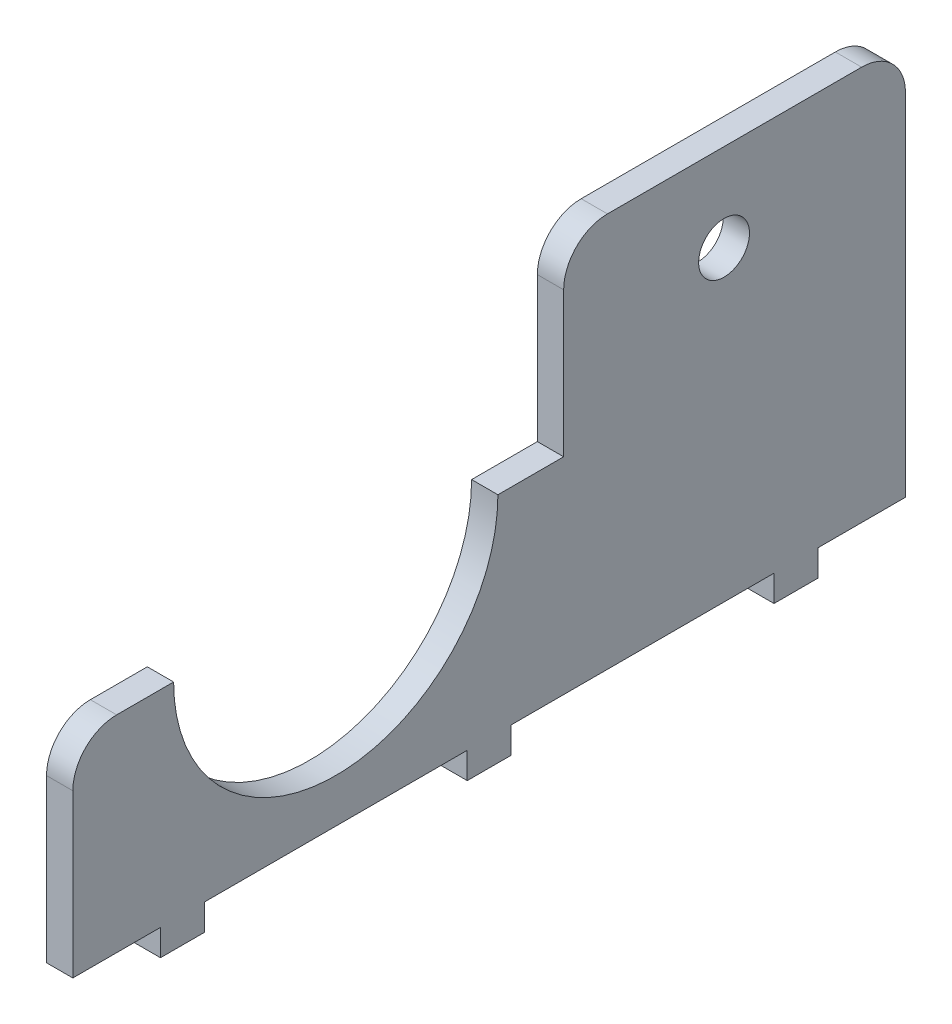
ISO-10303-21;
HEADER;
FILE_DESCRIPTION(('STEP AP214'),'2;1');
FILE_NAME('part.step','',(''),(''),'','','');
FILE_SCHEMA(('AUTOMOTIVE_DESIGN { 1 0 10303 214 1 1 1 1 }'));
ENDSEC;
DATA;
#1=APPLICATION_CONTEXT('core data for automotive mechanical design processes');
#2=APPLICATION_PROTOCOL_DEFINITION('international standard','automotive_design',2000,#1);
#3=PRODUCT_CONTEXT('',#1,'mechanical');
#4=PRODUCT('Part','Part','',(#3));
#5=PRODUCT_RELATED_PRODUCT_CATEGORY('part','',(#4));
#6=PRODUCT_DEFINITION_FORMATION('','',#4);
#7=PRODUCT_DEFINITION_CONTEXT('part definition',#1,'design');
#8=PRODUCT_DEFINITION('design','',#6,#7);
#9=PRODUCT_DEFINITION_SHAPE('','',#8);
#10=(LENGTH_UNIT() NAMED_UNIT(*) SI_UNIT(.MILLI.,.METRE.));
#11=(NAMED_UNIT(*) PLANE_ANGLE_UNIT() SI_UNIT($,.RADIAN.));
#12=(NAMED_UNIT(*) SI_UNIT($,.STERADIAN.) SOLID_ANGLE_UNIT());
#13=UNCERTAINTY_MEASURE_WITH_UNIT(LENGTH_MEASURE(1.E-05),#10,'distance_accuracy_value','');
#14=(GEOMETRIC_REPRESENTATION_CONTEXT(3) GLOBAL_UNCERTAINTY_ASSIGNED_CONTEXT((#13)) GLOBAL_UNIT_ASSIGNED_CONTEXT((#10,
#11,#12)) REPRESENTATION_CONTEXT('',''));
#15=CARTESIAN_POINT('',(0.,0.,0.));
#16=DIRECTION('',(0.,0.,1.));
#17=DIRECTION('',(1.,0.,0.));
#18=AXIS2_PLACEMENT_3D('',#15,#16,#17);
#19=CARTESIAN_POINT('',(3.,11.75,-47.5));
#20=DIRECTION('',(0.,-1.,0.));
#21=DIRECTION('',(0.,0.,-1.));
#22=AXIS2_PLACEMENT_3D('',#19,#20,#21);
#23=PLANE('',#22);
#24=DIRECTION('',(1.,0.,0.));
#25=VECTOR('',#24,1.);
#26=CARTESIAN_POINT('',(3.,11.75,-8.50000000000001));
#27=LINE('',#26,#25);
#28=CARTESIAN_POINT('',(0.,11.75,-8.50000000000001));
#29=VERTEX_POINT('',#28);
#30=CARTESIAN_POINT('',(3.,11.75,-8.50000000000003));
#31=VERTEX_POINT('',#30);
#32=EDGE_CURVE('E197',#29,#31,#27,.T.);
#33=ORIENTED_EDGE('',*,*,#32,.F.);
#34=DIRECTION('',(0.,0.,1.));
#35=VECTOR('',#34,1.);
#36=CARTESIAN_POINT('',(0.,11.75,-47.5));
#37=LINE('',#36,#35);
#38=CARTESIAN_POINT('',(0.,11.75,-1.00000000000001));
#39=VERTEX_POINT('',#38);
#40=EDGE_CURVE('E205',#29,#39,#37,.T.);
#41=ORIENTED_EDGE('',*,*,#40,.T.);
#42=DIRECTION('',(-1.,0.,0.));
#43=VECTOR('',#42,1.);
#44=CARTESIAN_POINT('',(3.,11.75,-1.00000000000001));
#45=LINE('',#44,#43);
#46=CARTESIAN_POINT('',(3.,11.75,-1.00000000000001));
#47=VERTEX_POINT('',#46);
#48=EDGE_CURVE('E338',#47,#39,#45,.T.);
#49=ORIENTED_EDGE('',*,*,#48,.F.);
#50=DIRECTION('',(0.,0.,1.));
#51=VECTOR('',#50,1.);
#52=CARTESIAN_POINT('',(3.,11.75,-47.5));
#53=LINE('',#52,#51);
#54=EDGE_CURVE('E216',#31,#47,#53,.T.);
#55=ORIENTED_EDGE('',*,*,#54,.F.);
#56=EDGE_LOOP('',(#33,#41,#49,#55));
#57=FACE_BOUND('',#56,.T.);
#58=ADVANCED_FACE('F39',(#57),#23,.F.);
#59=CARTESIAN_POINT('',(3.,-11.75,-47.5));
#60=DIRECTION('',(0.,1.,0.));
#61=DIRECTION('',(0.,0.,1.));
#62=AXIS2_PLACEMENT_3D('',#59,#60,#61);
#63=PLANE('',#62);
#64=DIRECTION('',(1.,0.,0.));
#65=VECTOR('',#64,1.);
#66=CARTESIAN_POINT('',(0.,-11.75,32.5));
#67=LINE('',#66,#65);
#68=CARTESIAN_POINT('',(0.,-11.75,32.5));
#69=VERTEX_POINT('',#68);
#70=CARTESIAN_POINT('',(3.,-11.75,32.5));
#71=VERTEX_POINT('',#70);
#72=EDGE_CURVE('E201',#69,#71,#67,.T.);
#73=ORIENTED_EDGE('',*,*,#72,.F.);
#74=DIRECTION('',(0.,0.,-1.));
#75=VECTOR('',#74,1.);
#76=CARTESIAN_POINT('',(0.,-11.75,-47.5));
#77=LINE('',#76,#75);
#78=CARTESIAN_POINT('',(0.,-11.75,2.49999999999998));
#79=VERTEX_POINT('',#78);
#80=EDGE_CURVE('E330',#69,#79,#77,.T.);
#81=ORIENTED_EDGE('',*,*,#80,.T.);
#82=DIRECTION('',(-1.,0.,0.));
#83=VECTOR('',#82,1.);
#84=CARTESIAN_POINT('',(0.,-11.75,2.49999999999998));
#85=LINE('',#84,#83);
#86=CARTESIAN_POINT('',(3.,-11.75,2.49999999999998));
#87=VERTEX_POINT('',#86);
#88=EDGE_CURVE('E259',#87,#79,#85,.T.);
#89=ORIENTED_EDGE('',*,*,#88,.F.);
#90=DIRECTION('',(0.,0.,-1.));
#91=VECTOR('',#90,1.);
#92=CARTESIAN_POINT('',(3.,-11.75,-47.5));
#93=LINE('',#92,#91);
#94=EDGE_CURVE('E317',#71,#87,#93,.T.);
#95=ORIENTED_EDGE('',*,*,#94,.F.);
#96=EDGE_LOOP('',(#73,#81,#89,#95));
#97=FACE_BOUND('',#96,.T.);
#98=ADVANCED_FACE('F392',(#97),#63,.F.);
#99=DIRECTION('',(-1.,0.,0.));
#100=VECTOR('',#99,1.);
#101=CARTESIAN_POINT('',(0.,-11.75,37.5));
#102=LINE('',#101,#100);
#103=CARTESIAN_POINT('',(3.,-11.75,37.5));
#104=VERTEX_POINT('',#103);
#105=CARTESIAN_POINT('',(0.,-11.75,37.5));
#106=VERTEX_POINT('',#105);
#107=EDGE_CURVE('E232',#104,#106,#102,.T.);
#108=ORIENTED_EDGE('',*,*,#107,.F.);
#109=CARTESIAN_POINT('',(3.,-11.75,47.5));
#110=VERTEX_POINT('',#109);
#111=EDGE_CURVE('E313',#110,#104,#93,.T.);
#112=ORIENTED_EDGE('',*,*,#111,.F.);
#113=DIRECTION('',(-1.,0.,0.));
#114=VECTOR('',#113,1.);
#115=CARTESIAN_POINT('',(3.,-11.75,47.5));
#116=LINE('',#115,#114);
#117=CARTESIAN_POINT('',(0.,-11.75,47.5));
#118=VERTEX_POINT('',#117);
#119=EDGE_CURVE('E343',#110,#118,#116,.T.);
#120=ORIENTED_EDGE('',*,*,#119,.T.);
#121=EDGE_CURVE('E328',#118,#106,#77,.T.);
#122=ORIENTED_EDGE('',*,*,#121,.T.);
#123=EDGE_LOOP('',(#108,#112,#120,#122));
#124=FACE_BOUND('',#123,.T.);
#125=ADVANCED_FACE('F397',(#124),#63,.F.);
#126=DIRECTION('',(1.,0.,0.));
#127=VECTOR('',#126,1.);
#128=CARTESIAN_POINT('',(0.,-11.75,-2.50000000000002));
#129=LINE('',#128,#127);
#130=CARTESIAN_POINT('',(0.,-11.75,-2.50000000000002));
#131=VERTEX_POINT('',#130);
#132=CARTESIAN_POINT('',(3.,-11.75,-2.50000000000002));
#133=VERTEX_POINT('',#132);
#134=EDGE_CURVE('E254',#131,#133,#129,.T.);
#135=ORIENTED_EDGE('',*,*,#134,.F.);
#136=CARTESIAN_POINT('',(0.,-11.75,-32.5));
#137=VERTEX_POINT('',#136);
#138=EDGE_CURVE('E431',#131,#137,#77,.T.);
#139=ORIENTED_EDGE('',*,*,#138,.T.);
#140=DIRECTION('',(-1.,0.,0.));
#141=VECTOR('',#140,1.);
#142=CARTESIAN_POINT('',(0.,-11.75,-32.5));
#143=LINE('',#142,#141);
#144=CARTESIAN_POINT('',(3.,-11.75,-32.5));
#145=VERTEX_POINT('',#144);
#146=EDGE_CURVE('E286',#145,#137,#143,.T.);
#147=ORIENTED_EDGE('',*,*,#146,.F.);
#148=EDGE_CURVE('E450',#133,#145,#93,.T.);
#149=ORIENTED_EDGE('',*,*,#148,.F.);
#150=EDGE_LOOP('',(#135,#139,#147,#149));
#151=FACE_BOUND('',#150,.T.);
#152=ADVANCED_FACE('F400',(#151),#63,.F.);
#153=DIRECTION('',(1.,0.,0.));
#154=VECTOR('',#153,1.);
#155=CARTESIAN_POINT('',(0.,-11.75,-37.5));
#156=LINE('',#155,#154);
#157=CARTESIAN_POINT('',(0.,-11.75,-37.5));
#158=VERTEX_POINT('',#157);
#159=CARTESIAN_POINT('',(3.00000000000002,-11.75,-37.5));
#160=VERTEX_POINT('',#159);
#161=EDGE_CURVE('E281',#158,#160,#156,.T.);
#162=ORIENTED_EDGE('',*,*,#161,.F.);
#163=CARTESIAN_POINT('',(0.,-11.75,-47.5));
#164=VERTEX_POINT('',#163);
#165=EDGE_CURVE('E327',#158,#164,#77,.T.);
#166=ORIENTED_EDGE('',*,*,#165,.T.);
#167=DIRECTION('',(-1.,0.,0.));
#168=VECTOR('',#167,1.);
#169=CARTESIAN_POINT('',(3.,-11.75,-47.5));
#170=LINE('',#169,#168);
#171=CARTESIAN_POINT('',(3.,-11.75,-47.5));
#172=VERTEX_POINT('',#171);
#173=EDGE_CURVE('E340',#172,#164,#170,.T.);
#174=ORIENTED_EDGE('',*,*,#173,.F.);
#175=EDGE_CURVE('E311',#160,#172,#93,.T.);
#176=ORIENTED_EDGE('',*,*,#175,.F.);
#177=EDGE_LOOP('',(#162,#166,#174,#176));
#178=FACE_BOUND('',#177,.T.);
#179=ADVANCED_FACE('F409',(#178),#63,.F.);
#180=CARTESIAN_POINT('',(3.,-11.75,47.5));
#181=DIRECTION('',(0.,0.,-1.));
#182=DIRECTION('',(-1.,0.,0.));
#183=AXIS2_PLACEMENT_3D('',#180,#181,#182);
#184=PLANE('',#183);
#185=DIRECTION('',(0.,-1.,0.));
#186=VECTOR('',#185,1.);
#187=CARTESIAN_POINT('',(3.,-11.75,47.5));
#188=LINE('',#187,#186);
#189=CARTESIAN_POINT('',(3.,6.75,47.5));
#190=VERTEX_POINT('',#189);
#191=EDGE_CURVE('E309',#190,#110,#188,.T.);
#192=ORIENTED_EDGE('',*,*,#191,.F.);
#193=DIRECTION('',(-1.,0.,0.));
#194=VECTOR('',#193,1.);
#195=CARTESIAN_POINT('',(3.,6.75,47.5));
#196=LINE('',#195,#194);
#197=CARTESIAN_POINT('',(0.,6.75,47.5));
#198=VERTEX_POINT('',#197);
#199=EDGE_CURVE('E346',#190,#198,#196,.T.);
#200=ORIENTED_EDGE('',*,*,#199,.T.);
#201=DIRECTION('',(0.,-1.,0.));
#202=VECTOR('',#201,1.);
#203=CARTESIAN_POINT('',(0.,-11.75,47.5));
#204=LINE('',#203,#202);
#205=EDGE_CURVE('E308',#198,#118,#204,.T.);
#206=ORIENTED_EDGE('',*,*,#205,.T.);
#207=ORIENTED_EDGE('',*,*,#119,.F.);
#208=EDGE_LOOP('',(#192,#200,#206,#207));
#209=FACE_BOUND('',#208,.T.);
#210=ADVANCED_FACE('F405',(#209),#184,.F.);
#211=CARTESIAN_POINT('',(3.,-11.75,-47.5));
#212=DIRECTION('',(0.,0.,1.));
#213=DIRECTION('',(1.,0.,0.));
#214=AXIS2_PLACEMENT_3D('',#211,#212,#213);
#215=PLANE('',#214);
#216=DIRECTION('',(0.,1.,0.));
#217=VECTOR('',#216,1.);
#218=CARTESIAN_POINT('',(0.,-11.75,-47.5));
#219=LINE('',#218,#217);
#220=CARTESIAN_POINT('',(0.,28.25,-47.5));
#221=VERTEX_POINT('',#220);
#222=EDGE_CURVE('E213',#164,#221,#219,.T.);
#223=ORIENTED_EDGE('',*,*,#222,.T.);
#224=DIRECTION('',(-1.,0.,0.));
#225=VECTOR('',#224,1.);
#226=CARTESIAN_POINT('',(3.,28.25,-47.5));
#227=LINE('',#226,#225);
#228=CARTESIAN_POINT('',(3.,28.25,-47.5));
#229=VERTEX_POINT('',#228);
#230=EDGE_CURVE('E11',#221,#229,#227,.F.);
#231=ORIENTED_EDGE('',*,*,#230,.T.);
#232=DIRECTION('',(0.,1.,0.));
#233=VECTOR('',#232,1.);
#234=CARTESIAN_POINT('',(3.,-11.75,-47.5));
#235=LINE('',#234,#233);
#236=EDGE_CURVE('E316',#172,#229,#235,.T.);
#237=ORIENTED_EDGE('',*,*,#236,.F.);
#238=ORIENTED_EDGE('',*,*,#173,.T.);
#239=EDGE_LOOP('',(#223,#231,#237,#238));
#240=FACE_BOUND('',#239,.T.);
#241=ADVANCED_FACE('F403',(#240),#215,.F.);
#242=CARTESIAN_POINT('',(3.,11.75,17.5));
#243=DIRECTION('',(-1.,0.,0.));
#244=DIRECTION('',(0.,0.,1.));
#245=AXIS2_PLACEMENT_3D('',#242,#243,#244);
#246=CYLINDRICAL_SURFACE('',#245,18.5);
#247=CARTESIAN_POINT('',(0.,11.75,17.5));
#248=DIRECTION('',(-1.,0.,0.));
#249=DIRECTION('',(0.,0.,-1.));
#250=AXIS2_PLACEMENT_3D('',#247,#248,#249);
#251=CIRCLE('',#250,18.5);
#252=CARTESIAN_POINT('',(0.,11.75,36.));
#253=VERTEX_POINT('',#252);
#254=EDGE_CURVE('E209',#39,#253,#251,.T.);
#255=ORIENTED_EDGE('',*,*,#254,.T.);
#256=DIRECTION('',(-1.,0.,0.));
#257=VECTOR('',#256,1.);
#258=CARTESIAN_POINT('',(3.,11.75,36.));
#259=LINE('',#258,#257);
#260=CARTESIAN_POINT('',(3.,11.75,36.));
#261=VERTEX_POINT('',#260);
#262=EDGE_CURVE('E325',#261,#253,#259,.T.);
#263=ORIENTED_EDGE('',*,*,#262,.F.);
#264=CARTESIAN_POINT('',(3.,11.75,17.5));
#265=DIRECTION('',(-1.,0.,0.));
#266=DIRECTION('',(0.,0.,-1.));
#267=AXIS2_PLACEMENT_3D('',#264,#265,#266);
#268=CIRCLE('',#267,18.5);
#269=EDGE_CURVE('E320',#47,#261,#268,.T.);
#270=ORIENTED_EDGE('',*,*,#269,.F.);
#271=ORIENTED_EDGE('',*,*,#48,.T.);
#272=EDGE_LOOP('',(#255,#263,#270,#271));
#273=FACE_BOUND('',#272,.T.);
#274=ADVANCED_FACE('F387',(#273),#246,.F.);
#275=CARTESIAN_POINT('',(3.,11.75,36.));
#276=DIRECTION('',(0.,-1.,0.));
#277=DIRECTION('',(0.,0.,-1.));
#278=AXIS2_PLACEMENT_3D('',#275,#276,#277);
#279=PLANE('',#278);
#280=DIRECTION('',(0.,0.,1.));
#281=VECTOR('',#280,1.);
#282=CARTESIAN_POINT('',(0.,11.75,36.));
#283=LINE('',#282,#281);
#284=CARTESIAN_POINT('',(0.,11.75,42.5));
#285=VERTEX_POINT('',#284);
#286=EDGE_CURVE('E312',#253,#285,#283,.T.);
#287=ORIENTED_EDGE('',*,*,#286,.T.);
#288=DIRECTION('',(-1.,0.,0.));
#289=VECTOR('',#288,1.);
#290=CARTESIAN_POINT('',(3.,11.75,42.5));
#291=LINE('',#290,#289);
#292=CARTESIAN_POINT('',(3.,11.75,42.5));
#293=VERTEX_POINT('',#292);
#294=EDGE_CURVE('E355',#285,#293,#291,.F.);
#295=ORIENTED_EDGE('',*,*,#294,.T.);
#296=DIRECTION('',(0.,0.,1.));
#297=VECTOR('',#296,1.);
#298=CARTESIAN_POINT('',(3.,11.75,36.));
#299=LINE('',#298,#297);
#300=EDGE_CURVE('E322',#261,#293,#299,.T.);
#301=ORIENTED_EDGE('',*,*,#300,.F.);
#302=ORIENTED_EDGE('',*,*,#262,.T.);
#303=EDGE_LOOP('',(#287,#295,#301,#302));
#304=FACE_BOUND('',#303,.T.);
#305=ADVANCED_FACE('F377',(#304),#279,.F.);
#306=CARTESIAN_POINT('',(3.,11.75,17.5));
#307=DIRECTION('',(1.,0.,0.));
#308=DIRECTION('',(0.,0.,-1.));
#309=AXIS2_PLACEMENT_3D('',#306,#307,#308);
#310=PLANE('',#309);
#311=CARTESIAN_POINT('',(3.00000000000002,23.25,-26.8));
#312=DIRECTION('',(-1.,0.,0.));
#313=DIRECTION('',(0.,0.,-1.));
#314=AXIS2_PLACEMENT_3D('',#311,#312,#313);
#315=CIRCLE('',#314,2.9);
#316=CARTESIAN_POINT('',(3.00000000000002,23.25,-29.7));
#317=VERTEX_POINT('',#316);
#318=EDGE_CURVE('E218',#317,#317,#315,.T.);
#319=ORIENTED_EDGE('',*,*,#318,.T.);
#320=EDGE_LOOP('',(#319));
#321=FACE_BOUND('',#320,.T.);
#322=ORIENTED_EDGE('',*,*,#300,.T.);
#323=CARTESIAN_POINT('',(3.,6.75,42.5));
#324=DIRECTION('',(1.,0.,0.));
#325=DIRECTION('',(0.,0.,-1.));
#326=AXIS2_PLACEMENT_3D('',#323,#324,#325);
#327=CIRCLE('',#326,5.);
#328=EDGE_CURVE('E359',#293,#190,#327,.T.);
#329=ORIENTED_EDGE('',*,*,#328,.T.);
#330=ORIENTED_EDGE('',*,*,#191,.T.);
#331=ORIENTED_EDGE('',*,*,#111,.T.);
#332=DIRECTION('',(0.,1.,0.));
#333=VECTOR('',#332,1.);
#334=CARTESIAN_POINT('',(3.,-14.75,37.5));
#335=LINE('',#334,#333);
#336=CARTESIAN_POINT('',(3.,-14.75,37.5));
#337=VERTEX_POINT('',#336);
#338=EDGE_CURVE('E245',#337,#104,#335,.T.);
#339=ORIENTED_EDGE('',*,*,#338,.F.);
#340=DIRECTION('',(0.,0.,1.));
#341=VECTOR('',#340,1.);
#342=CARTESIAN_POINT('',(3.,-14.75,37.5));
#343=LINE('',#342,#341);
#344=CARTESIAN_POINT('',(3.,-14.75,32.5));
#345=VERTEX_POINT('',#344);
#346=EDGE_CURVE('E234',#345,#337,#343,.T.);
#347=ORIENTED_EDGE('',*,*,#346,.F.);
#348=DIRECTION('',(0.,1.,0.));
#349=VECTOR('',#348,1.);
#350=CARTESIAN_POINT('',(3.,-14.75,32.5));
#351=LINE('',#350,#349);
#352=EDGE_CURVE('E248',#345,#71,#351,.T.);
#353=ORIENTED_EDGE('',*,*,#352,.T.);
#354=ORIENTED_EDGE('',*,*,#94,.T.);
#355=DIRECTION('',(0.,1.,0.));
#356=VECTOR('',#355,1.);
#357=CARTESIAN_POINT('',(3.00000000000001,-14.75,2.49999999999998));
#358=LINE('',#357,#356);
#359=CARTESIAN_POINT('',(3.00000000000001,-14.75,2.49999999999998));
#360=VERTEX_POINT('',#359);
#361=EDGE_CURVE('E272',#360,#87,#358,.T.);
#362=ORIENTED_EDGE('',*,*,#361,.F.);
#363=DIRECTION('',(0.,0.,1.));
#364=VECTOR('',#363,1.);
#365=CARTESIAN_POINT('',(3.00000000000001,-14.75,-2.50000000000002));
#366=LINE('',#365,#364);
#367=CARTESIAN_POINT('',(3.00000000000001,-14.75,-2.50000000000002));
#368=VERTEX_POINT('',#367);
#369=EDGE_CURVE('E261',#368,#360,#366,.T.);
#370=ORIENTED_EDGE('',*,*,#369,.F.);
#371=DIRECTION('',(0.,1.,0.));
#372=VECTOR('',#371,1.);
#373=CARTESIAN_POINT('',(3.00000000000001,-14.75,-2.50000000000002));
#374=LINE('',#373,#372);
#375=EDGE_CURVE('E275',#368,#133,#374,.T.);
#376=ORIENTED_EDGE('',*,*,#375,.T.);
#377=ORIENTED_EDGE('',*,*,#148,.T.);
#378=DIRECTION('',(0.,1.,0.));
#379=VECTOR('',#378,1.);
#380=CARTESIAN_POINT('',(3.00000000000002,-14.75,-32.5));
#381=LINE('',#380,#379);
#382=CARTESIAN_POINT('',(3.00000000000002,-14.75,-32.5));
#383=VERTEX_POINT('',#382);
#384=EDGE_CURVE('E299',#383,#145,#381,.T.);
#385=ORIENTED_EDGE('',*,*,#384,.F.);
#386=DIRECTION('',(0.,0.,1.));
#387=VECTOR('',#386,1.);
#388=CARTESIAN_POINT('',(3.00000000000002,-14.75,-37.5));
#389=LINE('',#388,#387);
#390=CARTESIAN_POINT('',(3.00000000000002,-14.75,-37.5));
#391=VERTEX_POINT('',#390);
#392=EDGE_CURVE('E288',#391,#383,#389,.T.);
#393=ORIENTED_EDGE('',*,*,#392,.F.);
#394=DIRECTION('',(0.,1.,0.));
#395=VECTOR('',#394,1.);
#396=CARTESIAN_POINT('',(3.00000000000002,-14.75,-37.5));
#397=LINE('',#396,#395);
#398=EDGE_CURVE('E302',#391,#160,#397,.T.);
#399=ORIENTED_EDGE('',*,*,#398,.T.);
#400=ORIENTED_EDGE('',*,*,#175,.T.);
#401=ORIENTED_EDGE('',*,*,#236,.T.);
#402=CARTESIAN_POINT('',(3.,28.25,-42.5));
#403=DIRECTION('',(1.,0.,0.));
#404=DIRECTION('',(0.,0.,-1.));
#405=AXIS2_PLACEMENT_3D('',#402,#403,#404);
#406=CIRCLE('',#405,5.);
#407=CARTESIAN_POINT('',(3.,33.25,-42.5));
#408=VERTEX_POINT('',#407);
#409=EDGE_CURVE('E60',#229,#408,#406,.T.);
#410=ORIENTED_EDGE('',*,*,#409,.T.);
#411=DIRECTION('',(0.,0.,-1.));
#412=VECTOR('',#411,1.);
#413=CARTESIAN_POINT('',(3.,33.25,-47.5));
#414=LINE('',#413,#412);
#415=CARTESIAN_POINT('',(3.,33.25,-13.5));
#416=VERTEX_POINT('',#415);
#417=EDGE_CURVE('E217',#416,#408,#414,.T.);
#418=ORIENTED_EDGE('',*,*,#417,.F.);
#419=CARTESIAN_POINT('',(3.,28.25,-13.5));
#420=DIRECTION('',(1.,0.,0.));
#421=DIRECTION('',(0.,0.,-1.));
#422=AXIS2_PLACEMENT_3D('',#419,#420,#421);
#423=CIRCLE('',#422,5.);
#424=CARTESIAN_POINT('',(3.,28.25,-8.50000000000001));
#425=VERTEX_POINT('',#424);
#426=EDGE_CURVE('E54',#416,#425,#423,.T.);
#427=ORIENTED_EDGE('',*,*,#426,.T.);
#428=DIRECTION('',(0.,-1.,0.));
#429=VECTOR('',#428,1.);
#430=CARTESIAN_POINT('',(3.,33.25,-8.50000000000001));
#431=LINE('',#430,#429);
#432=EDGE_CURVE('E202',#425,#31,#431,.T.);
#433=ORIENTED_EDGE('',*,*,#432,.T.);
#434=ORIENTED_EDGE('',*,*,#54,.T.);
#435=ORIENTED_EDGE('',*,*,#269,.T.);
#436=EDGE_LOOP('',(#322,#329,#330,#331,#339,#347,#353,#354,#362,#370,#376,#377,#385,#393,#399,
#400,#401,#410,#418,#427,#433,#434,#435));
#437=FACE_BOUND('',#436,.T.);
#438=ADVANCED_FACE('F373',(#321,#437),#310,.T.);
#439=CARTESIAN_POINT('',(0.,11.75,17.5));
#440=DIRECTION('',(1.,0.,0.));
#441=DIRECTION('',(0.,0.,-1.));
#442=AXIS2_PLACEMENT_3D('',#439,#440,#441);
#443=PLANE('',#442);
#444=CARTESIAN_POINT('',(0.,23.25,-26.8));
#445=DIRECTION('',(-1.,0.,0.));
#446=DIRECTION('',(0.,0.,1.));
#447=AXIS2_PLACEMENT_3D('',#444,#445,#446);
#448=CIRCLE('',#447,2.9);
#449=CARTESIAN_POINT('',(0.,23.25,-23.9));
#450=VERTEX_POINT('',#449);
#451=EDGE_CURVE('E223',#450,#450,#448,.T.);
#452=ORIENTED_EDGE('',*,*,#451,.F.);
#453=EDGE_LOOP('',(#452));
#454=FACE_BOUND('',#453,.T.);
#455=ORIENTED_EDGE('',*,*,#205,.F.);
#456=CARTESIAN_POINT('',(0.,6.75,42.5));
#457=DIRECTION('',(1.,0.,0.));
#458=DIRECTION('',(0.,0.,-1.));
#459=AXIS2_PLACEMENT_3D('',#456,#457,#458);
#460=CIRCLE('',#459,5.);
#461=EDGE_CURVE('E353',#198,#285,#460,.F.);
#462=ORIENTED_EDGE('',*,*,#461,.T.);
#463=ORIENTED_EDGE('',*,*,#286,.F.);
#464=ORIENTED_EDGE('',*,*,#254,.F.);
#465=ORIENTED_EDGE('',*,*,#40,.F.);
#466=DIRECTION('',(0.,-1.,0.));
#467=VECTOR('',#466,1.);
#468=CARTESIAN_POINT('',(0.,33.25,-8.50000000000001));
#469=LINE('',#468,#467);
#470=CARTESIAN_POINT('',(0.,28.25,-8.50000000000001));
#471=VERTEX_POINT('',#470);
#472=EDGE_CURVE('E193',#471,#29,#469,.T.);
#473=ORIENTED_EDGE('',*,*,#472,.F.);
#474=CARTESIAN_POINT('',(0.,28.25,-13.5));
#475=DIRECTION('',(1.,0.,0.));
#476=DIRECTION('',(0.,0.,-1.));
#477=AXIS2_PLACEMENT_3D('',#474,#475,#476);
#478=CIRCLE('',#477,5.);
#479=CARTESIAN_POINT('',(0.,33.25,-13.5));
#480=VERTEX_POINT('',#479);
#481=EDGE_CURVE('E351',#471,#480,#478,.F.);
#482=ORIENTED_EDGE('',*,*,#481,.T.);
#483=DIRECTION('',(0.,0.,1.));
#484=VECTOR('',#483,1.);
#485=CARTESIAN_POINT('',(0.,33.25,-47.5));
#486=LINE('',#485,#484);
#487=CARTESIAN_POINT('',(0.,33.25,-42.5));
#488=VERTEX_POINT('',#487);
#489=EDGE_CURVE('E220',#488,#480,#486,.T.);
#490=ORIENTED_EDGE('',*,*,#489,.F.);
#491=CARTESIAN_POINT('',(0.,28.25,-42.5));
#492=DIRECTION('',(1.,0.,0.));
#493=DIRECTION('',(0.,0.,-1.));
#494=AXIS2_PLACEMENT_3D('',#491,#492,#493);
#495=CIRCLE('',#494,5.);
#496=EDGE_CURVE('E349',#488,#221,#495,.F.);
#497=ORIENTED_EDGE('',*,*,#496,.T.);
#498=ORIENTED_EDGE('',*,*,#222,.F.);
#499=ORIENTED_EDGE('',*,*,#165,.F.);
#500=DIRECTION('',(0.,1.,0.));
#501=VECTOR('',#500,1.);
#502=CARTESIAN_POINT('',(0.,-14.75,-37.5));
#503=LINE('',#502,#501);
#504=CARTESIAN_POINT('',(0.,-14.75,-37.5));
#505=VERTEX_POINT('',#504);
#506=EDGE_CURVE('E305',#505,#158,#503,.T.);
#507=ORIENTED_EDGE('',*,*,#506,.F.);
#508=DIRECTION('',(0.,0.,-1.));
#509=VECTOR('',#508,1.);
#510=CARTESIAN_POINT('',(0.,-14.75,-37.5));
#511=LINE('',#510,#509);
#512=CARTESIAN_POINT('',(0.,-14.75,-32.5));
#513=VERTEX_POINT('',#512);
#514=EDGE_CURVE('E282',#513,#505,#511,.T.);
#515=ORIENTED_EDGE('',*,*,#514,.F.);
#516=DIRECTION('',(0.,1.,0.));
#517=VECTOR('',#516,1.);
#518=CARTESIAN_POINT('',(0.,-14.75,-32.5));
#519=LINE('',#518,#517);
#520=EDGE_CURVE('E292',#513,#137,#519,.T.);
#521=ORIENTED_EDGE('',*,*,#520,.T.);
#522=ORIENTED_EDGE('',*,*,#138,.F.);
#523=DIRECTION('',(0.,1.,0.));
#524=VECTOR('',#523,1.);
#525=CARTESIAN_POINT('',(0.,-14.75,-2.50000000000002));
#526=LINE('',#525,#524);
#527=CARTESIAN_POINT('',(0.,-14.75,-2.50000000000002));
#528=VERTEX_POINT('',#527);
#529=EDGE_CURVE('E278',#528,#131,#526,.T.);
#530=ORIENTED_EDGE('',*,*,#529,.F.);
#531=DIRECTION('',(0.,0.,-1.));
#532=VECTOR('',#531,1.);
#533=CARTESIAN_POINT('',(0.,-14.75,-2.50000000000002));
#534=LINE('',#533,#532);
#535=CARTESIAN_POINT('',(0.,-14.75,2.49999999999998));
#536=VERTEX_POINT('',#535);
#537=EDGE_CURVE('E255',#536,#528,#534,.T.);
#538=ORIENTED_EDGE('',*,*,#537,.F.);
#539=DIRECTION('',(0.,1.,0.));
#540=VECTOR('',#539,1.);
#541=CARTESIAN_POINT('',(0.,-14.75,2.49999999999998));
#542=LINE('',#541,#540);
#543=EDGE_CURVE('E265',#536,#79,#542,.T.);
#544=ORIENTED_EDGE('',*,*,#543,.T.);
#545=ORIENTED_EDGE('',*,*,#80,.F.);
#546=DIRECTION('',(0.,1.,0.));
#547=VECTOR('',#546,1.);
#548=CARTESIAN_POINT('',(0.,-14.75,32.5));
#549=LINE('',#548,#547);
#550=CARTESIAN_POINT('',(0.,-14.75,32.5));
#551=VERTEX_POINT('',#550);
#552=EDGE_CURVE('E251',#551,#69,#549,.T.);
#553=ORIENTED_EDGE('',*,*,#552,.F.);
#554=DIRECTION('',(0.,0.,-1.));
#555=VECTOR('',#554,1.);
#556=CARTESIAN_POINT('',(0.,-14.75,37.5));
#557=LINE('',#556,#555);
#558=CARTESIAN_POINT('',(0.,-14.75,37.5));
#559=VERTEX_POINT('',#558);
#560=EDGE_CURVE('E228',#559,#551,#557,.T.);
#561=ORIENTED_EDGE('',*,*,#560,.F.);
#562=DIRECTION('',(0.,1.,0.));
#563=VECTOR('',#562,1.);
#564=CARTESIAN_POINT('',(0.,-14.75,37.5));
#565=LINE('',#564,#563);
#566=EDGE_CURVE('E238',#559,#106,#565,.T.);
#567=ORIENTED_EDGE('',*,*,#566,.T.);
#568=ORIENTED_EDGE('',*,*,#121,.F.);
#569=EDGE_LOOP('',(#455,#462,#463,#464,#465,#473,#482,#490,#497,#498,#499,#507,#515,#521,#522,
#530,#538,#544,#545,#553,#561,#567,#568));
#570=FACE_BOUND('',#569,.T.);
#571=ADVANCED_FACE('F207',(#454,#570),#443,.F.);
#572=CARTESIAN_POINT('',(0.,-14.75,-37.5));
#573=DIRECTION('',(0.,0.,1.));
#574=DIRECTION('',(0.,-1.,0.));
#575=AXIS2_PLACEMENT_3D('',#572,#573,#574);
#576=PLANE('',#575);
#577=ORIENTED_EDGE('',*,*,#161,.T.);
#578=ORIENTED_EDGE('',*,*,#398,.F.);
#579=DIRECTION('',(1.,0.,0.));
#580=VECTOR('',#579,1.);
#581=CARTESIAN_POINT('',(0.,-14.75,-37.5));
#582=LINE('',#581,#580);
#583=EDGE_CURVE('E285',#505,#391,#582,.T.);
#584=ORIENTED_EDGE('',*,*,#583,.F.);
#585=ORIENTED_EDGE('',*,*,#506,.T.);
#586=EDGE_LOOP('',(#577,#578,#584,#585));
#587=FACE_BOUND('',#586,.T.);
#588=ADVANCED_FACE('F384',(#587),#576,.F.);
#589=CARTESIAN_POINT('',(0.,-14.75,-32.5));
#590=DIRECTION('',(0.,0.,-1.));
#591=DIRECTION('',(0.,1.,0.));
#592=AXIS2_PLACEMENT_3D('',#589,#590,#591);
#593=PLANE('',#592);
#594=ORIENTED_EDGE('',*,*,#146,.T.);
#595=ORIENTED_EDGE('',*,*,#520,.F.);
#596=DIRECTION('',(-1.,0.,0.));
#597=VECTOR('',#596,1.);
#598=CARTESIAN_POINT('',(0.,-14.75,-32.5));
#599=LINE('',#598,#597);
#600=EDGE_CURVE('E290',#383,#513,#599,.T.);
#601=ORIENTED_EDGE('',*,*,#600,.F.);
#602=ORIENTED_EDGE('',*,*,#384,.T.);
#603=EDGE_LOOP('',(#594,#595,#601,#602));
#604=FACE_BOUND('',#603,.T.);
#605=ADVANCED_FACE('F461',(#604),#593,.F.);
#606=CARTESIAN_POINT('',(0.,-14.75,0.));
#607=DIRECTION('',(0.,1.,0.));
#608=DIRECTION('',(0.,0.,1.));
#609=AXIS2_PLACEMENT_3D('',#606,#607,#608);
#610=PLANE('',#609);
#611=ORIENTED_EDGE('',*,*,#514,.T.);
#612=ORIENTED_EDGE('',*,*,#583,.T.);
#613=ORIENTED_EDGE('',*,*,#392,.T.);
#614=ORIENTED_EDGE('',*,*,#600,.T.);
#615=EDGE_LOOP('',(#611,#612,#613,#614));
#616=FACE_BOUND('',#615,.T.);
#617=ADVANCED_FACE('F458',(#616),#610,.F.);
#618=CARTESIAN_POINT('',(0.,-14.75,-2.50000000000002));
#619=DIRECTION('',(0.,0.,1.));
#620=DIRECTION('',(1.,0.,0.));
#621=AXIS2_PLACEMENT_3D('',#618,#619,#620);
#622=PLANE('',#621);
#623=ORIENTED_EDGE('',*,*,#134,.T.);
#624=ORIENTED_EDGE('',*,*,#375,.F.);
#625=DIRECTION('',(1.,0.,0.));
#626=VECTOR('',#625,1.);
#627=CARTESIAN_POINT('',(0.,-14.75,-2.50000000000002));
#628=LINE('',#627,#626);
#629=EDGE_CURVE('E258',#528,#368,#628,.T.);
#630=ORIENTED_EDGE('',*,*,#629,.F.);
#631=ORIENTED_EDGE('',*,*,#529,.T.);
#632=EDGE_LOOP('',(#623,#624,#630,#631));
#633=FACE_BOUND('',#632,.T.);
#634=ADVANCED_FACE('F463',(#633),#622,.F.);
#635=CARTESIAN_POINT('',(0.,-14.75,2.49999999999998));
#636=DIRECTION('',(0.,0.,-1.));
#637=DIRECTION('',(-1.,0.,0.));
#638=AXIS2_PLACEMENT_3D('',#635,#636,#637);
#639=PLANE('',#638);
#640=ORIENTED_EDGE('',*,*,#88,.T.);
#641=ORIENTED_EDGE('',*,*,#543,.F.);
#642=DIRECTION('',(-1.,0.,0.));
#643=VECTOR('',#642,1.);
#644=CARTESIAN_POINT('',(0.,-14.75,2.49999999999998));
#645=LINE('',#644,#643);
#646=EDGE_CURVE('E263',#360,#536,#645,.T.);
#647=ORIENTED_EDGE('',*,*,#646,.F.);
#648=ORIENTED_EDGE('',*,*,#361,.T.);
#649=EDGE_LOOP('',(#640,#641,#647,#648));
#650=FACE_BOUND('',#649,.T.);
#651=ADVANCED_FACE('F439',(#650),#639,.F.);
#652=CARTESIAN_POINT('',(0.,-14.75,0.));
#653=DIRECTION('',(0.,1.,0.));
#654=DIRECTION('',(0.,0.,1.));
#655=AXIS2_PLACEMENT_3D('',#652,#653,#654);
#656=PLANE('',#655);
#657=ORIENTED_EDGE('',*,*,#537,.T.);
#658=ORIENTED_EDGE('',*,*,#629,.T.);
#659=ORIENTED_EDGE('',*,*,#369,.T.);
#660=ORIENTED_EDGE('',*,*,#646,.T.);
#661=EDGE_LOOP('',(#657,#658,#659,#660));
#662=FACE_BOUND('',#661,.T.);
#663=ADVANCED_FACE('F445',(#662),#656,.F.);
#664=CARTESIAN_POINT('',(0.,-14.75,32.5));
#665=DIRECTION('',(0.,0.,1.));
#666=DIRECTION('',(0.,-1.,0.));
#667=AXIS2_PLACEMENT_3D('',#664,#665,#666);
#668=PLANE('',#667);
#669=ORIENTED_EDGE('',*,*,#72,.T.);
#670=ORIENTED_EDGE('',*,*,#352,.F.);
#671=DIRECTION('',(1.,0.,0.));
#672=VECTOR('',#671,1.);
#673=CARTESIAN_POINT('',(0.,-14.75,32.5));
#674=LINE('',#673,#672);
#675=EDGE_CURVE('E231',#551,#345,#674,.T.);
#676=ORIENTED_EDGE('',*,*,#675,.F.);
#677=ORIENTED_EDGE('',*,*,#552,.T.);
#678=EDGE_LOOP('',(#669,#670,#676,#677));
#679=FACE_BOUND('',#678,.T.);
#680=ADVANCED_FACE('F508',(#679),#668,.F.);
#681=CARTESIAN_POINT('',(0.,-14.75,37.5));
#682=DIRECTION('',(0.,0.,-1.));
#683=DIRECTION('',(0.,1.,0.));
#684=AXIS2_PLACEMENT_3D('',#681,#682,#683);
#685=PLANE('',#684);
#686=ORIENTED_EDGE('',*,*,#107,.T.);
#687=ORIENTED_EDGE('',*,*,#566,.F.);
#688=DIRECTION('',(-1.,0.,0.));
#689=VECTOR('',#688,1.);
#690=CARTESIAN_POINT('',(0.,-14.75,37.5));
#691=LINE('',#690,#689);
#692=EDGE_CURVE('E236',#337,#559,#691,.T.);
#693=ORIENTED_EDGE('',*,*,#692,.F.);
#694=ORIENTED_EDGE('',*,*,#338,.T.);
#695=EDGE_LOOP('',(#686,#687,#693,#694));
#696=FACE_BOUND('',#695,.T.);
#697=ADVANCED_FACE('F516',(#696),#685,.F.);
#698=CARTESIAN_POINT('',(0.,-14.75,0.));
#699=DIRECTION('',(0.,-1.,0.));
#700=DIRECTION('',(0.,0.,-1.));
#701=AXIS2_PLACEMENT_3D('',#698,#699,#700);
#702=PLANE('',#701);
#703=ORIENTED_EDGE('',*,*,#560,.T.);
#704=ORIENTED_EDGE('',*,*,#675,.T.);
#705=ORIENTED_EDGE('',*,*,#346,.T.);
#706=ORIENTED_EDGE('',*,*,#692,.T.);
#707=EDGE_LOOP('',(#703,#704,#705,#706));
#708=FACE_BOUND('',#707,.T.);
#709=ADVANCED_FACE('F526',(#708),#702,.T.);
#710=CARTESIAN_POINT('',(3.,33.25,-8.50000000000001));
#711=DIRECTION('',(0.,0.,-1.));
#712=DIRECTION('',(-1.,0.,0.));
#713=AXIS2_PLACEMENT_3D('',#710,#711,#712);
#714=PLANE('',#713);
#715=ORIENTED_EDGE('',*,*,#432,.F.);
#716=DIRECTION('',(1.,0.,0.));
#717=VECTOR('',#716,1.);
#718=CARTESIAN_POINT('',(3.,28.25,-8.50000000000001));
#719=LINE('',#718,#717);
#720=EDGE_CURVE('E47',#425,#471,#719,.F.);
#721=ORIENTED_EDGE('',*,*,#720,.T.);
#722=ORIENTED_EDGE('',*,*,#472,.T.);
#723=ORIENTED_EDGE('',*,*,#32,.T.);
#724=EDGE_LOOP('',(#715,#721,#722,#723));
#725=FACE_BOUND('',#724,.T.);
#726=ADVANCED_FACE('F195',(#725),#714,.F.);
#727=CARTESIAN_POINT('',(0.,33.25,0.));
#728=DIRECTION('',(0.,-1.,0.));
#729=DIRECTION('',(0.,0.,-1.));
#730=AXIS2_PLACEMENT_3D('',#727,#728,#729);
#731=PLANE('',#730);
#732=ORIENTED_EDGE('',*,*,#489,.T.);
#733=DIRECTION('',(1.,0.,0.));
#734=VECTOR('',#733,1.);
#735=CARTESIAN_POINT('',(0.,33.25,-13.5));
#736=LINE('',#735,#734);
#737=EDGE_CURVE('E364',#480,#416,#736,.T.);
#738=ORIENTED_EDGE('',*,*,#737,.T.);
#739=ORIENTED_EDGE('',*,*,#417,.T.);
#740=DIRECTION('',(-1.,0.,0.));
#741=VECTOR('',#740,1.);
#742=CARTESIAN_POINT('',(0.,33.25,-42.5));
#743=LINE('',#742,#741);
#744=EDGE_CURVE('E361',#408,#488,#743,.T.);
#745=ORIENTED_EDGE('',*,*,#744,.T.);
#746=EDGE_LOOP('',(#732,#738,#739,#745));
#747=FACE_BOUND('',#746,.T.);
#748=ADVANCED_FACE('F369',(#747),#731,.F.);
#749=CARTESIAN_POINT('',(3.00000000000002,23.25,-26.8));
#750=DIRECTION('',(-1.,0.,0.));
#751=DIRECTION('',(0.,0.,1.));
#752=AXIS2_PLACEMENT_3D('',#749,#750,#751);
#753=CYLINDRICAL_SURFACE('',#752,2.9);
#754=ORIENTED_EDGE('',*,*,#451,.T.);
#755=EDGE_LOOP('',(#754));
#756=FACE_BOUND('',#755,.T.);
#757=ORIENTED_EDGE('',*,*,#318,.F.);
#758=EDGE_LOOP('',(#757));
#759=FACE_BOUND('',#758,.T.);
#760=ADVANCED_FACE('F417',(#756,#759),#753,.F.);
#761=CARTESIAN_POINT('',(3.,6.75,42.5));
#762=DIRECTION('',(-1.,0.,0.));
#763=DIRECTION('',(0.,0.,1.));
#764=AXIS2_PLACEMENT_3D('',#761,#762,#763);
#765=CYLINDRICAL_SURFACE('',#764,5.);
#766=ORIENTED_EDGE('',*,*,#328,.F.);
#767=ORIENTED_EDGE('',*,*,#294,.F.);
#768=ORIENTED_EDGE('',*,*,#461,.F.);
#769=ORIENTED_EDGE('',*,*,#199,.F.);
#770=EDGE_LOOP('',(#766,#767,#768,#769));
#771=FACE_BOUND('',#770,.T.);
#772=ADVANCED_FACE('F414',(#771),#765,.T.);
#773=CARTESIAN_POINT('',(0.,28.25,-13.5));
#774=DIRECTION('',(1.,0.,0.));
#775=DIRECTION('',(0.,0.,-1.));
#776=AXIS2_PLACEMENT_3D('',#773,#774,#775);
#777=CYLINDRICAL_SURFACE('',#776,5.);
#778=ORIENTED_EDGE('',*,*,#481,.F.);
#779=ORIENTED_EDGE('',*,*,#720,.F.);
#780=ORIENTED_EDGE('',*,*,#426,.F.);
#781=ORIENTED_EDGE('',*,*,#737,.F.);
#782=EDGE_LOOP('',(#778,#779,#780,#781));
#783=FACE_BOUND('',#782,.T.);
#784=ADVANCED_FACE('F416',(#783),#777,.T.);
#785=CARTESIAN_POINT('',(0.,28.25,-42.5));
#786=DIRECTION('',(-1.,0.,0.));
#787=DIRECTION('',(0.,-1.,0.));
#788=AXIS2_PLACEMENT_3D('',#785,#786,#787);
#789=CYLINDRICAL_SURFACE('',#788,5.);
#790=ORIENTED_EDGE('',*,*,#409,.F.);
#791=ORIENTED_EDGE('',*,*,#230,.F.);
#792=ORIENTED_EDGE('',*,*,#496,.F.);
#793=ORIENTED_EDGE('',*,*,#744,.F.);
#794=EDGE_LOOP('',(#790,#791,#792,#793));
#795=FACE_BOUND('',#794,.T.);
#796=ADVANCED_FACE('F41',(#795),#789,.T.);
#797=CLOSED_SHELL('',(#58,#98,#125,#152,#179,#210,#241,#274,#305,#438,#571,#588,#605,#617,#634,
#651,#663,#680,#697,#709,#726,#748,#760,#772,#784,#796));
#798=MANIFOLD_SOLID_BREP('B2',#797);
#799=ADVANCED_BREP_SHAPE_REPRESENTATION('',(#18,#798),#14);
#800=SHAPE_DEFINITION_REPRESENTATION(#9,#799);
ENDSEC;
END-ISO-10303-21;
